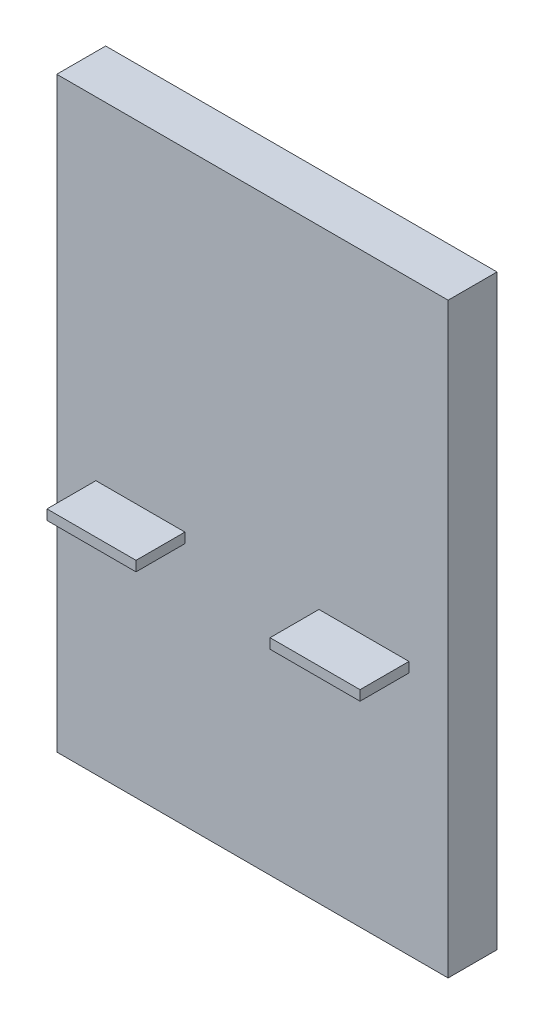
ISO-10303-21;
HEADER;
FILE_DESCRIPTION(('STEP AP214'),'2;1');
FILE_NAME('part.step','',(''),(''),'','','');
FILE_SCHEMA(('AUTOMOTIVE_DESIGN { 1 0 10303 214 1 1 1 1 }'));
ENDSEC;
DATA;
#1=APPLICATION_CONTEXT('core data for automotive mechanical design processes');
#2=APPLICATION_PROTOCOL_DEFINITION('international standard','automotive_design',2000,#1);
#3=PRODUCT_CONTEXT('',#1,'mechanical');
#4=PRODUCT('Part','Part','',(#3));
#5=PRODUCT_RELATED_PRODUCT_CATEGORY('part','',(#4));
#6=PRODUCT_DEFINITION_FORMATION('','',#4);
#7=PRODUCT_DEFINITION_CONTEXT('part definition',#1,'design');
#8=PRODUCT_DEFINITION('design','',#6,#7);
#9=PRODUCT_DEFINITION_SHAPE('','',#8);
#10=(LENGTH_UNIT() NAMED_UNIT(*) SI_UNIT(.MILLI.,.METRE.));
#11=(NAMED_UNIT(*) PLANE_ANGLE_UNIT() SI_UNIT($,.RADIAN.));
#12=(NAMED_UNIT(*) SI_UNIT($,.STERADIAN.) SOLID_ANGLE_UNIT());
#13=UNCERTAINTY_MEASURE_WITH_UNIT(LENGTH_MEASURE(1.E-05),#10,'distance_accuracy_value','');
#14=(GEOMETRIC_REPRESENTATION_CONTEXT(3) GLOBAL_UNCERTAINTY_ASSIGNED_CONTEXT((#13)) GLOBAL_UNIT_ASSIGNED_CONTEXT((#10,
#11,#12)) REPRESENTATION_CONTEXT('',''));
#15=CARTESIAN_POINT('',(0.,0.,0.));
#16=DIRECTION('',(0.,0.,1.));
#17=DIRECTION('',(1.,0.,0.));
#18=AXIS2_PLACEMENT_3D('',#15,#16,#17);
#19=CARTESIAN_POINT('',(0.,0.,0.));
#20=DIRECTION('',(0.,0.,-1.));
#21=DIRECTION('',(-1.,0.,0.));
#22=AXIS2_PLACEMENT_3D('',#19,#20,#21);
#23=PLANE('',#22);
#24=DIRECTION('',(0.,-1.,0.));
#25=VECTOR('',#24,1.);
#26=CARTESIAN_POINT('',(-0.8,1.25,0.));
#27=LINE('',#26,#25);
#28=CARTESIAN_POINT('',(-0.8,1.30119353143523,0.));
#29=VERTEX_POINT('',#28);
#30=CARTESIAN_POINT('',(-0.8,1.25,0.));
#31=VERTEX_POINT('',#30);
#32=EDGE_CURVE('E147',#29,#31,#27,.T.);
#33=ORIENTED_EDGE('',*,*,#32,.F.);
#34=DIRECTION('',(-1.,0.,0.));
#35=VECTOR('',#34,1.);
#36=CARTESIAN_POINT('',(-0.8,1.30119353143523,0.));
#37=LINE('',#36,#35);
#38=CARTESIAN_POINT('',(-0.344987373897849,1.30119353143523,0.));
#39=VERTEX_POINT('',#38);
#40=EDGE_CURVE('E160',#39,#29,#37,.T.);
#41=ORIENTED_EDGE('',*,*,#40,.F.);
#42=DIRECTION('',(0.,1.,0.));
#43=VECTOR('',#42,1.);
#44=CARTESIAN_POINT('',(-0.344987373897849,1.25,0.));
#45=LINE('',#44,#43);
#46=CARTESIAN_POINT('',(-0.344987373897849,1.25,0.));
#47=VERTEX_POINT('',#46);
#48=EDGE_CURVE('E169',#47,#39,#45,.T.);
#49=ORIENTED_EDGE('',*,*,#48,.F.);
#50=DIRECTION('',(1.,0.,0.));
#51=VECTOR('',#50,1.);
#52=CARTESIAN_POINT('',(-0.8,1.25,0.));
#53=LINE('',#52,#51);
#54=EDGE_CURVE('E150',#31,#47,#53,.T.);
#55=ORIENTED_EDGE('',*,*,#54,.F.);
#56=EDGE_LOOP('',(#33,#41,#49,#55));
#57=FACE_BOUND('',#56,.T.);
#58=DIRECTION('',(0.,-1.,0.));
#59=VECTOR('',#58,1.);
#60=CARTESIAN_POINT('',(-1.,0.,0.));
#61=LINE('',#60,#59);
#62=CARTESIAN_POINT('',(-1.,3.,0.));
#63=VERTEX_POINT('',#62);
#64=CARTESIAN_POINT('',(-1.,0.,0.));
#65=VERTEX_POINT('',#64);
#66=EDGE_CURVE('E185',#63,#65,#61,.T.);
#67=ORIENTED_EDGE('',*,*,#66,.T.);
#68=DIRECTION('',(1.,0.,0.));
#69=VECTOR('',#68,1.);
#70=CARTESIAN_POINT('',(-1.,0.,0.));
#71=LINE('',#70,#69);
#72=CARTESIAN_POINT('',(1.,0.,0.));
#73=VERTEX_POINT('',#72);
#74=EDGE_CURVE('E201',#65,#73,#71,.T.);
#75=ORIENTED_EDGE('',*,*,#74,.T.);
#76=DIRECTION('',(0.,1.,0.));
#77=VECTOR('',#76,1.);
#78=CARTESIAN_POINT('',(1.,0.,0.));
#79=LINE('',#78,#77);
#80=CARTESIAN_POINT('',(1.,3.,0.));
#81=VERTEX_POINT('',#80);
#82=EDGE_CURVE('E204',#73,#81,#79,.T.);
#83=ORIENTED_EDGE('',*,*,#82,.T.);
#84=DIRECTION('',(-1.,0.,0.));
#85=VECTOR('',#84,1.);
#86=CARTESIAN_POINT('',(-1.,3.,0.));
#87=LINE('',#86,#85);
#88=EDGE_CURVE('E190',#81,#63,#87,.T.);
#89=ORIENTED_EDGE('',*,*,#88,.T.);
#90=EDGE_LOOP('',(#67,#75,#83,#89));
#91=FACE_BOUND('',#90,.T.);
#92=DIRECTION('',(0.,-1.,0.));
#93=VECTOR('',#92,1.);
#94=CARTESIAN_POINT('',(0.34,1.30119353143523,0.));
#95=LINE('',#94,#93);
#96=CARTESIAN_POINT('',(0.34,1.30119353143523,0.));
#97=VERTEX_POINT('',#96);
#98=CARTESIAN_POINT('',(0.34,1.25,0.));
#99=VERTEX_POINT('',#98);
#100=EDGE_CURVE('E146',#97,#99,#95,.T.);
#101=ORIENTED_EDGE('',*,*,#100,.F.);
#102=DIRECTION('',(-1.,0.,0.));
#103=VECTOR('',#102,1.);
#104=CARTESIAN_POINT('',(0.34,1.30119353143523,0.));
#105=LINE('',#104,#103);
#106=CARTESIAN_POINT('',(0.8,1.30119353143523,0.));
#107=VERTEX_POINT('',#106);
#108=EDGE_CURVE('E143',#107,#97,#105,.T.);
#109=ORIENTED_EDGE('',*,*,#108,.F.);
#110=DIRECTION('',(0.,1.,0.));
#111=VECTOR('',#110,1.);
#112=CARTESIAN_POINT('',(0.8,1.30119353143523,0.));
#113=LINE('',#112,#111);
#114=CARTESIAN_POINT('',(0.8,1.25,0.));
#115=VERTEX_POINT('',#114);
#116=EDGE_CURVE('E58',#115,#107,#113,.T.);
#117=ORIENTED_EDGE('',*,*,#116,.F.);
#118=DIRECTION('',(1.,0.,0.));
#119=VECTOR('',#118,1.);
#120=CARTESIAN_POINT('',(0.34,1.25,0.));
#121=LINE('',#120,#119);
#122=EDGE_CURVE('E53',#99,#115,#121,.T.);
#123=ORIENTED_EDGE('',*,*,#122,.F.);
#124=EDGE_LOOP('',(#101,#109,#117,#123));
#125=FACE_BOUND('',#124,.T.);
#126=ADVANCED_FACE('F36',(#57,#91,#125),#23,.F.);
#127=CARTESIAN_POINT('',(-1.,0.,-0.25));
#128=DIRECTION('',(-1.,0.,0.));
#129=DIRECTION('',(0.,0.,1.));
#130=AXIS2_PLACEMENT_3D('',#127,#128,#129);
#131=PLANE('',#130);
#132=ORIENTED_EDGE('',*,*,#66,.F.);
#133=DIRECTION('',(0.,0.,1.));
#134=VECTOR('',#133,1.);
#135=CARTESIAN_POINT('',(-1.,3.,-0.25));
#136=LINE('',#135,#134);
#137=CARTESIAN_POINT('',(-1.,3.,-0.25));
#138=VERTEX_POINT('',#137);
#139=EDGE_CURVE('E11',#138,#63,#136,.T.);
#140=ORIENTED_EDGE('',*,*,#139,.F.);
#141=DIRECTION('',(0.,-1.,0.));
#142=VECTOR('',#141,1.);
#143=CARTESIAN_POINT('',(-1.,0.,-0.25));
#144=LINE('',#143,#142);
#145=CARTESIAN_POINT('',(-1.,0.,-0.25));
#146=VERTEX_POINT('',#145);
#147=EDGE_CURVE('E186',#138,#146,#144,.T.);
#148=ORIENTED_EDGE('',*,*,#147,.T.);
#149=DIRECTION('',(0.,0.,1.));
#150=VECTOR('',#149,1.);
#151=CARTESIAN_POINT('',(-1.,0.,-0.25));
#152=LINE('',#151,#150);
#153=EDGE_CURVE('E40',#146,#65,#152,.T.);
#154=ORIENTED_EDGE('',*,*,#153,.T.);
#155=EDGE_LOOP('',(#132,#140,#148,#154));
#156=FACE_BOUND('',#155,.T.);
#157=ADVANCED_FACE('F38',(#156),#131,.T.);
#158=CARTESIAN_POINT('',(-1.,3.,-0.25));
#159=DIRECTION('',(0.,1.,0.));
#160=DIRECTION('',(0.,0.,1.));
#161=AXIS2_PLACEMENT_3D('',#158,#159,#160);
#162=PLANE('',#161);
#163=ORIENTED_EDGE('',*,*,#88,.F.);
#164=DIRECTION('',(0.,0.,1.));
#165=VECTOR('',#164,1.);
#166=CARTESIAN_POINT('',(1.,3.,-0.25));
#167=LINE('',#166,#165);
#168=CARTESIAN_POINT('',(1.,3.,-0.25));
#169=VERTEX_POINT('',#168);
#170=EDGE_CURVE('E45',#169,#81,#167,.T.);
#171=ORIENTED_EDGE('',*,*,#170,.F.);
#172=DIRECTION('',(-1.,0.,0.));
#173=VECTOR('',#172,1.);
#174=CARTESIAN_POINT('',(-1.,3.,-0.25));
#175=LINE('',#174,#173);
#176=EDGE_CURVE('E196',#169,#138,#175,.T.);
#177=ORIENTED_EDGE('',*,*,#176,.T.);
#178=ORIENTED_EDGE('',*,*,#139,.T.);
#179=EDGE_LOOP('',(#163,#171,#177,#178));
#180=FACE_BOUND('',#179,.T.);
#181=ADVANCED_FACE('F221',(#180),#162,.T.);
#182=CARTESIAN_POINT('',(1.,0.,-0.25));
#183=DIRECTION('',(1.,0.,0.));
#184=DIRECTION('',(0.,0.,-1.));
#185=AXIS2_PLACEMENT_3D('',#182,#183,#184);
#186=PLANE('',#185);
#187=ORIENTED_EDGE('',*,*,#82,.F.);
#188=DIRECTION('',(0.,0.,1.));
#189=VECTOR('',#188,1.);
#190=CARTESIAN_POINT('',(1.,0.,-0.25));
#191=LINE('',#190,#189);
#192=CARTESIAN_POINT('',(1.,0.,-0.25));
#193=VERTEX_POINT('',#192);
#194=EDGE_CURVE('E209',#193,#73,#191,.T.);
#195=ORIENTED_EDGE('',*,*,#194,.F.);
#196=DIRECTION('',(0.,1.,0.));
#197=VECTOR('',#196,1.);
#198=CARTESIAN_POINT('',(1.,0.,-0.25));
#199=LINE('',#198,#197);
#200=EDGE_CURVE('E193',#193,#169,#199,.T.);
#201=ORIENTED_EDGE('',*,*,#200,.T.);
#202=ORIENTED_EDGE('',*,*,#170,.T.);
#203=EDGE_LOOP('',(#187,#195,#201,#202));
#204=FACE_BOUND('',#203,.T.);
#205=ADVANCED_FACE('F227',(#204),#186,.T.);
#206=CARTESIAN_POINT('',(-1.,0.,-0.25));
#207=DIRECTION('',(0.,-1.,0.));
#208=DIRECTION('',(0.,0.,-1.));
#209=AXIS2_PLACEMENT_3D('',#206,#207,#208);
#210=PLANE('',#209);
#211=ORIENTED_EDGE('',*,*,#74,.F.);
#212=ORIENTED_EDGE('',*,*,#153,.F.);
#213=DIRECTION('',(1.,0.,0.));
#214=VECTOR('',#213,1.);
#215=CARTESIAN_POINT('',(-1.,0.,-0.25));
#216=LINE('',#215,#214);
#217=EDGE_CURVE('E189',#146,#193,#216,.T.);
#218=ORIENTED_EDGE('',*,*,#217,.T.);
#219=ORIENTED_EDGE('',*,*,#194,.T.);
#220=EDGE_LOOP('',(#211,#212,#218,#219));
#221=FACE_BOUND('',#220,.T.);
#222=ADVANCED_FACE('F217',(#221),#210,.T.);
#223=CARTESIAN_POINT('',(0.,0.,-0.25));
#224=DIRECTION('',(0.,0.,-1.));
#225=DIRECTION('',(-1.,0.,0.));
#226=AXIS2_PLACEMENT_3D('',#223,#224,#225);
#227=PLANE('',#226);
#228=ORIENTED_EDGE('',*,*,#147,.F.);
#229=ORIENTED_EDGE('',*,*,#176,.F.);
#230=ORIENTED_EDGE('',*,*,#200,.F.);
#231=ORIENTED_EDGE('',*,*,#217,.F.);
#232=EDGE_LOOP('',(#228,#229,#230,#231));
#233=FACE_BOUND('',#232,.T.);
#234=ADVANCED_FACE('F224',(#233),#227,.T.);
#235=CARTESIAN_POINT('',(-0.8,1.25,0.25));
#236=DIRECTION('',(1.,0.,0.));
#237=DIRECTION('',(0.,1.,0.));
#238=AXIS2_PLACEMENT_3D('',#235,#236,#237);
#239=PLANE('',#238);
#240=ORIENTED_EDGE('',*,*,#32,.T.);
#241=DIRECTION('',(0.,0.,-1.));
#242=VECTOR('',#241,1.);
#243=CARTESIAN_POINT('',(-0.8,1.25,0.25));
#244=LINE('',#243,#242);
#245=CARTESIAN_POINT('',(-0.8,1.25,0.25));
#246=VERTEX_POINT('',#245);
#247=EDGE_CURVE('E182',#246,#31,#244,.T.);
#248=ORIENTED_EDGE('',*,*,#247,.F.);
#249=DIRECTION('',(0.,-1.,0.));
#250=VECTOR('',#249,1.);
#251=CARTESIAN_POINT('',(-0.8,1.25,0.25));
#252=LINE('',#251,#250);
#253=CARTESIAN_POINT('',(-0.8,1.30119353143523,0.25));
#254=VERTEX_POINT('',#253);
#255=EDGE_CURVE('E156',#254,#246,#252,.T.);
#256=ORIENTED_EDGE('',*,*,#255,.F.);
#257=DIRECTION('',(0.,0.,-1.));
#258=VECTOR('',#257,1.);
#259=CARTESIAN_POINT('',(-0.8,1.30119353143523,0.25));
#260=LINE('',#259,#258);
#261=EDGE_CURVE('E165',#254,#29,#260,.T.);
#262=ORIENTED_EDGE('',*,*,#261,.T.);
#263=EDGE_LOOP('',(#240,#248,#256,#262));
#264=FACE_BOUND('',#263,.T.);
#265=ADVANCED_FACE('F244',(#264),#239,.F.);
#266=CARTESIAN_POINT('',(-0.8,1.25,0.25));
#267=DIRECTION('',(0.,1.,0.));
#268=DIRECTION('',(0.,0.,1.));
#269=AXIS2_PLACEMENT_3D('',#266,#267,#268);
#270=PLANE('',#269);
#271=ORIENTED_EDGE('',*,*,#54,.T.);
#272=DIRECTION('',(0.,0.,-1.));
#273=VECTOR('',#272,1.);
#274=CARTESIAN_POINT('',(-0.344987373897849,1.25,0.25));
#275=LINE('',#274,#273);
#276=CARTESIAN_POINT('',(-0.344987373897849,1.25,0.25));
#277=VERTEX_POINT('',#276);
#278=EDGE_CURVE('E179',#277,#47,#275,.T.);
#279=ORIENTED_EDGE('',*,*,#278,.F.);
#280=DIRECTION('',(1.,0.,0.));
#281=VECTOR('',#280,1.);
#282=CARTESIAN_POINT('',(-0.8,1.25,0.25));
#283=LINE('',#282,#281);
#284=EDGE_CURVE('E159',#246,#277,#283,.T.);
#285=ORIENTED_EDGE('',*,*,#284,.F.);
#286=ORIENTED_EDGE('',*,*,#247,.T.);
#287=EDGE_LOOP('',(#271,#279,#285,#286));
#288=FACE_BOUND('',#287,.T.);
#289=ADVANCED_FACE('F247',(#288),#270,.F.);
#290=CARTESIAN_POINT('',(-0.344987373897849,1.25,0.25));
#291=DIRECTION('',(-1.,0.,0.));
#292=DIRECTION('',(0.,-1.,0.));
#293=AXIS2_PLACEMENT_3D('',#290,#291,#292);
#294=PLANE('',#293);
#295=ORIENTED_EDGE('',*,*,#48,.T.);
#296=DIRECTION('',(0.,0.,-1.));
#297=VECTOR('',#296,1.);
#298=CARTESIAN_POINT('',(-0.344987373897849,1.30119353143523,0.25));
#299=LINE('',#298,#297);
#300=CARTESIAN_POINT('',(-0.344987373897849,1.30119353143523,0.25));
#301=VERTEX_POINT('',#300);
#302=EDGE_CURVE('E176',#301,#39,#299,.T.);
#303=ORIENTED_EDGE('',*,*,#302,.F.);
#304=DIRECTION('',(0.,1.,0.));
#305=VECTOR('',#304,1.);
#306=CARTESIAN_POINT('',(-0.344987373897849,1.25,0.25));
#307=LINE('',#306,#305);
#308=EDGE_CURVE('E162',#277,#301,#307,.T.);
#309=ORIENTED_EDGE('',*,*,#308,.F.);
#310=ORIENTED_EDGE('',*,*,#278,.T.);
#311=EDGE_LOOP('',(#295,#303,#309,#310));
#312=FACE_BOUND('',#311,.T.);
#313=ADVANCED_FACE('F251',(#312),#294,.F.);
#314=CARTESIAN_POINT('',(-0.8,1.30119353143523,0.25));
#315=DIRECTION('',(0.,-1.,0.));
#316=DIRECTION('',(0.,0.,-1.));
#317=AXIS2_PLACEMENT_3D('',#314,#315,#316);
#318=PLANE('',#317);
#319=ORIENTED_EDGE('',*,*,#40,.T.);
#320=ORIENTED_EDGE('',*,*,#261,.F.);
#321=DIRECTION('',(-1.,0.,0.));
#322=VECTOR('',#321,1.);
#323=CARTESIAN_POINT('',(-0.8,1.30119353143523,0.25));
#324=LINE('',#323,#322);
#325=EDGE_CURVE('E164',#301,#254,#324,.T.);
#326=ORIENTED_EDGE('',*,*,#325,.F.);
#327=ORIENTED_EDGE('',*,*,#302,.T.);
#328=EDGE_LOOP('',(#319,#320,#326,#327));
#329=FACE_BOUND('',#328,.T.);
#330=ADVANCED_FACE('F255',(#329),#318,.F.);
#331=CARTESIAN_POINT('',(0.,0.,0.25));
#332=DIRECTION('',(0.,0.,-1.));
#333=DIRECTION('',(-1.,0.,0.));
#334=AXIS2_PLACEMENT_3D('',#331,#332,#333);
#335=PLANE('',#334);
#336=ORIENTED_EDGE('',*,*,#255,.T.);
#337=ORIENTED_EDGE('',*,*,#284,.T.);
#338=ORIENTED_EDGE('',*,*,#308,.T.);
#339=ORIENTED_EDGE('',*,*,#325,.T.);
#340=EDGE_LOOP('',(#336,#337,#338,#339));
#341=FACE_BOUND('',#340,.T.);
#342=ADVANCED_FACE('F259',(#341),#335,.F.);
#343=CARTESIAN_POINT('',(0.34,1.30119353143523,0.25));
#344=DIRECTION('',(1.,0.,0.));
#345=DIRECTION('',(0.,1.,0.));
#346=AXIS2_PLACEMENT_3D('',#343,#344,#345);
#347=PLANE('',#346);
#348=ORIENTED_EDGE('',*,*,#100,.T.);
#349=DIRECTION('',(0.,0.,-1.));
#350=VECTOR('',#349,1.);
#351=CARTESIAN_POINT('',(0.34,1.25,0.25));
#352=LINE('',#351,#350);
#353=CARTESIAN_POINT('',(0.34,1.25,0.25));
#354=VERTEX_POINT('',#353);
#355=EDGE_CURVE('E127',#354,#99,#352,.T.);
#356=ORIENTED_EDGE('',*,*,#355,.F.);
#357=DIRECTION('',(0.,-1.,0.));
#358=VECTOR('',#357,1.);
#359=CARTESIAN_POINT('',(0.34,1.30119353143523,0.25));
#360=LINE('',#359,#358);
#361=CARTESIAN_POINT('',(0.34,1.30119353143523,0.25));
#362=VERTEX_POINT('',#361);
#363=EDGE_CURVE('E134',#362,#354,#360,.T.);
#364=ORIENTED_EDGE('',*,*,#363,.F.);
#365=DIRECTION('',(0.,0.,-1.));
#366=VECTOR('',#365,1.);
#367=CARTESIAN_POINT('',(0.34,1.30119353143523,0.25));
#368=LINE('',#367,#366);
#369=EDGE_CURVE('E371',#362,#97,#368,.T.);
#370=ORIENTED_EDGE('',*,*,#369,.T.);
#371=EDGE_LOOP('',(#348,#356,#364,#370));
#372=FACE_BOUND('',#371,.T.);
#373=ADVANCED_FACE('F145',(#372),#347,.F.);
#374=CARTESIAN_POINT('',(0.34,1.25,0.25));
#375=DIRECTION('',(0.,1.,0.));
#376=DIRECTION('',(0.,0.,1.));
#377=AXIS2_PLACEMENT_3D('',#374,#375,#376);
#378=PLANE('',#377);
#379=ORIENTED_EDGE('',*,*,#122,.T.);
#380=DIRECTION('',(0.,0.,-1.));
#381=VECTOR('',#380,1.);
#382=CARTESIAN_POINT('',(0.8,1.25,0.25));
#383=LINE('',#382,#381);
#384=CARTESIAN_POINT('',(0.8,1.25,0.25));
#385=VERTEX_POINT('',#384);
#386=EDGE_CURVE('E130',#385,#115,#383,.T.);
#387=ORIENTED_EDGE('',*,*,#386,.F.);
#388=DIRECTION('',(1.,0.,0.));
#389=VECTOR('',#388,1.);
#390=CARTESIAN_POINT('',(0.34,1.25,0.25));
#391=LINE('',#390,#389);
#392=EDGE_CURVE('E123',#354,#385,#391,.T.);
#393=ORIENTED_EDGE('',*,*,#392,.F.);
#394=ORIENTED_EDGE('',*,*,#355,.T.);
#395=EDGE_LOOP('',(#379,#387,#393,#394));
#396=FACE_BOUND('',#395,.T.);
#397=ADVANCED_FACE('F125',(#396),#378,.F.);
#398=CARTESIAN_POINT('',(0.8,1.30119353143523,0.25));
#399=DIRECTION('',(-1.,0.,0.));
#400=DIRECTION('',(0.,-1.,0.));
#401=AXIS2_PLACEMENT_3D('',#398,#399,#400);
#402=PLANE('',#401);
#403=ORIENTED_EDGE('',*,*,#116,.T.);
#404=DIRECTION('',(0.,0.,-1.));
#405=VECTOR('',#404,1.);
#406=CARTESIAN_POINT('',(0.8,1.30119353143523,0.25));
#407=LINE('',#406,#405);
#408=CARTESIAN_POINT('',(0.8,1.30119353143523,0.25));
#409=VERTEX_POINT('',#408);
#410=EDGE_CURVE('E152',#409,#107,#407,.T.);
#411=ORIENTED_EDGE('',*,*,#410,.F.);
#412=DIRECTION('',(0.,1.,0.));
#413=VECTOR('',#412,1.);
#414=CARTESIAN_POINT('',(0.8,1.30119353143523,0.25));
#415=LINE('',#414,#413);
#416=EDGE_CURVE('E133',#385,#409,#415,.T.);
#417=ORIENTED_EDGE('',*,*,#416,.F.);
#418=ORIENTED_EDGE('',*,*,#386,.T.);
#419=EDGE_LOOP('',(#403,#411,#417,#418));
#420=FACE_BOUND('',#419,.T.);
#421=ADVANCED_FACE('F268',(#420),#402,.F.);
#422=CARTESIAN_POINT('',(0.34,1.30119353143523,0.25));
#423=DIRECTION('',(0.,-1.,0.));
#424=DIRECTION('',(0.,0.,-1.));
#425=AXIS2_PLACEMENT_3D('',#422,#423,#424);
#426=PLANE('',#425);
#427=ORIENTED_EDGE('',*,*,#108,.T.);
#428=ORIENTED_EDGE('',*,*,#369,.F.);
#429=DIRECTION('',(-1.,0.,0.));
#430=VECTOR('',#429,1.);
#431=CARTESIAN_POINT('',(0.34,1.30119353143523,0.25));
#432=LINE('',#431,#430);
#433=EDGE_CURVE('E139',#409,#362,#432,.T.);
#434=ORIENTED_EDGE('',*,*,#433,.F.);
#435=ORIENTED_EDGE('',*,*,#410,.T.);
#436=EDGE_LOOP('',(#427,#428,#434,#435));
#437=FACE_BOUND('',#436,.T.);
#438=ADVANCED_FACE('F271',(#437),#426,.F.);
#439=CARTESIAN_POINT('',(0.,0.,0.25));
#440=DIRECTION('',(0.,0.,1.));
#441=DIRECTION('',(1.,0.,0.));
#442=AXIS2_PLACEMENT_3D('',#439,#440,#441);
#443=PLANE('',#442);
#444=ORIENTED_EDGE('',*,*,#363,.T.);
#445=ORIENTED_EDGE('',*,*,#392,.T.);
#446=ORIENTED_EDGE('',*,*,#416,.T.);
#447=ORIENTED_EDGE('',*,*,#433,.T.);
#448=EDGE_LOOP('',(#444,#445,#446,#447));
#449=FACE_BOUND('',#448,.T.);
#450=ADVANCED_FACE('F137',(#449),#443,.T.);
#451=CLOSED_SHELL('',(#126,#157,#181,#205,#222,#234,#265,#289,#313,#330,#342,#373,#397,#421,
#438,#450));
#452=MANIFOLD_SOLID_BREP('B2',#451);
#453=ADVANCED_BREP_SHAPE_REPRESENTATION('',(#18,#452),#14);
#454=SHAPE_DEFINITION_REPRESENTATION(#9,#453);
ENDSEC;
END-ISO-10303-21;
